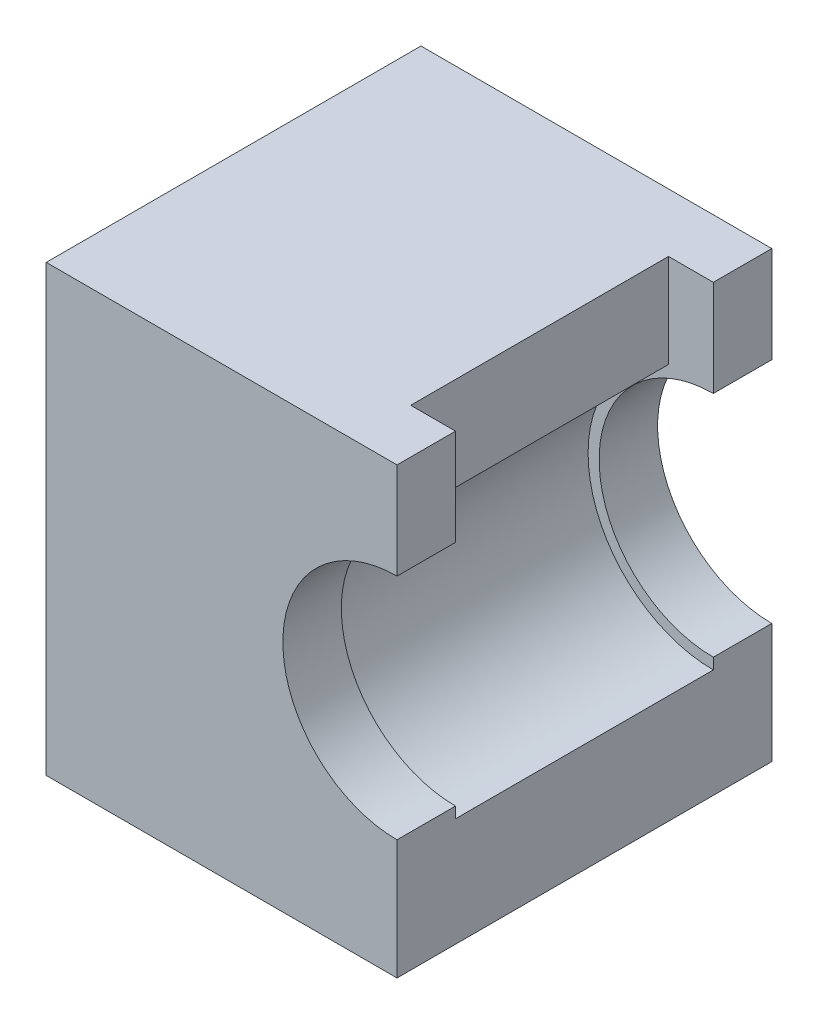
ISO-10303-21;
HEADER;
FILE_DESCRIPTION(('STEP AP214'),'2;1');
FILE_NAME('part.step','',(''),(''),'','','');
FILE_SCHEMA(('AUTOMOTIVE_DESIGN { 1 0 10303 214 1 1 1 1 }'));
ENDSEC;
DATA;
#1=APPLICATION_CONTEXT('core data for automotive mechanical design processes');
#2=APPLICATION_PROTOCOL_DEFINITION('international standard','automotive_design',2000,#1);
#3=PRODUCT_CONTEXT('',#1,'mechanical');
#4=PRODUCT('Part','Part','',(#3));
#5=PRODUCT_RELATED_PRODUCT_CATEGORY('part','',(#4));
#6=PRODUCT_DEFINITION_FORMATION('','',#4);
#7=PRODUCT_DEFINITION_CONTEXT('part definition',#1,'design');
#8=PRODUCT_DEFINITION('design','',#6,#7);
#9=PRODUCT_DEFINITION_SHAPE('','',#8);
#10=(LENGTH_UNIT() NAMED_UNIT(*) SI_UNIT(.MILLI.,.METRE.));
#11=(NAMED_UNIT(*) PLANE_ANGLE_UNIT() SI_UNIT($,.RADIAN.));
#12=(NAMED_UNIT(*) SI_UNIT($,.STERADIAN.) SOLID_ANGLE_UNIT());
#13=UNCERTAINTY_MEASURE_WITH_UNIT(LENGTH_MEASURE(1.E-05),#10,'distance_accuracy_value','');
#14=(GEOMETRIC_REPRESENTATION_CONTEXT(3) GLOBAL_UNCERTAINTY_ASSIGNED_CONTEXT((#13)) GLOBAL_UNIT_ASSIGNED_CONTEXT((#10,
#11,#12)) REPRESENTATION_CONTEXT('',''));
#15=CARTESIAN_POINT('',(0.,0.,0.));
#16=DIRECTION('',(0.,0.,1.));
#17=DIRECTION('',(1.,0.,0.));
#18=AXIS2_PLACEMENT_3D('',#15,#16,#17);
#19=CARTESIAN_POINT('',(0.,-6.35,7.));
#20=DIRECTION('',(0.,1.,0.));
#21=DIRECTION('',(0.,0.,1.));
#22=AXIS2_PLACEMENT_3D('',#19,#20,#21);
#23=PLANE('',#22);
#24=DIRECTION('',(0.,0.,-1.));
#25=VECTOR('',#24,1.);
#26=CARTESIAN_POINT('',(-9.525,-6.35,7.));
#27=LINE('',#26,#25);
#28=CARTESIAN_POINT('',(-9.525,-6.35,8.5875));
#29=VERTEX_POINT('',#28);
#30=CARTESIAN_POINT('',(-9.525,-6.35,-1.5875));
#31=VERTEX_POINT('',#30);
#32=EDGE_CURVE('E214',#29,#31,#27,.T.);
#33=ORIENTED_EDGE('',*,*,#32,.T.);
#34=DIRECTION('',(1.,0.,0.));
#35=VECTOR('',#34,1.);
#36=CARTESIAN_POINT('',(0.,-6.35,-1.5875));
#37=LINE('',#36,#35);
#38=CARTESIAN_POINT('',(0.,-6.35,-1.5875));
#39=VERTEX_POINT('',#38);
#40=EDGE_CURVE('E216',#31,#39,#37,.T.);
#41=ORIENTED_EDGE('',*,*,#40,.T.);
#42=DIRECTION('',(0.,0.,-1.));
#43=VECTOR('',#42,1.);
#44=CARTESIAN_POINT('',(0.,-6.35,7.));
#45=LINE('',#44,#43);
#46=CARTESIAN_POINT('',(0.,-6.35,8.5875));
#47=VERTEX_POINT('',#46);
#48=EDGE_CURVE('E130',#47,#39,#45,.T.);
#49=ORIENTED_EDGE('',*,*,#48,.F.);
#50=DIRECTION('',(1.,0.,0.));
#51=VECTOR('',#50,1.);
#52=CARTESIAN_POINT('',(0.,-6.35,8.5875));
#53=LINE('',#52,#51);
#54=EDGE_CURVE('E219',#29,#47,#53,.T.);
#55=ORIENTED_EDGE('',*,*,#54,.F.);
#56=EDGE_LOOP('',(#33,#41,#49,#55));
#57=FACE_BOUND('',#56,.T.);
#58=ADVANCED_FACE('F119',(#57),#23,.F.);
#59=CARTESIAN_POINT('',(0.,0.,7.));
#60=DIRECTION('',(-1.,0.,0.));
#61=DIRECTION('',(0.,0.,1.));
#62=AXIS2_PLACEMENT_3D('',#59,#60,#61);
#63=PLANE('',#62);
#64=ORIENTED_EDGE('',*,*,#48,.T.);
#65=DIRECTION('',(0.,1.,0.));
#66=VECTOR('',#65,1.);
#67=CARTESIAN_POINT('',(0.,0.,-1.5875));
#68=LINE('',#67,#66);
#69=CARTESIAN_POINT('',(0.,-3.10000000000001,-1.5875));
#70=VERTEX_POINT('',#69);
#71=EDGE_CURVE('E234',#39,#70,#68,.T.);
#72=ORIENTED_EDGE('',*,*,#71,.T.);
#73=DIRECTION('',(0.,0.,1.));
#74=VECTOR('',#73,1.);
#75=CARTESIAN_POINT('',(0.,-3.10000000000001,-1.5875));
#76=LINE('',#75,#74);
#77=CARTESIAN_POINT('',(0.,-3.10000000000001,0.));
#78=VERTEX_POINT('',#77);
#79=EDGE_CURVE('E253',#70,#78,#76,.T.);
#80=ORIENTED_EDGE('',*,*,#79,.T.);
#81=DIRECTION('',(0.,1.,0.));
#82=VECTOR('',#81,1.);
#83=CARTESIAN_POINT('',(0.,0.,0.));
#84=LINE('',#83,#82);
#85=CARTESIAN_POINT('',(0.,-3.4,0.));
#86=VERTEX_POINT('',#85);
#87=EDGE_CURVE('E236',#86,#78,#84,.T.);
#88=ORIENTED_EDGE('',*,*,#87,.F.);
#89=DIRECTION('',(0.,0.,-1.));
#90=VECTOR('',#89,1.);
#91=CARTESIAN_POINT('',(0.,-3.4,7.));
#92=LINE('',#91,#90);
#93=CARTESIAN_POINT('',(0.,-3.4,7.));
#94=VERTEX_POINT('',#93);
#95=EDGE_CURVE('E139',#94,#86,#92,.T.);
#96=ORIENTED_EDGE('',*,*,#95,.F.);
#97=DIRECTION('',(0.,1.,0.));
#98=VECTOR('',#97,1.);
#99=CARTESIAN_POINT('',(0.,0.,7.));
#100=LINE('',#99,#98);
#101=CARTESIAN_POINT('',(0.,-3.10000000000001,7.));
#102=VERTEX_POINT('',#101);
#103=EDGE_CURVE('E277',#94,#102,#100,.T.);
#104=ORIENTED_EDGE('',*,*,#103,.T.);
#105=DIRECTION('',(0.,0.,-1.));
#106=VECTOR('',#105,1.);
#107=CARTESIAN_POINT('',(0.,-3.10000000000001,8.5875));
#108=LINE('',#107,#106);
#109=CARTESIAN_POINT('',(0.,-3.10000000000001,8.5875));
#110=VERTEX_POINT('',#109);
#111=EDGE_CURVE('E318',#110,#102,#108,.T.);
#112=ORIENTED_EDGE('',*,*,#111,.F.);
#113=DIRECTION('',(0.,1.,0.));
#114=VECTOR('',#113,1.);
#115=CARTESIAN_POINT('',(0.,0.,8.5875));
#116=LINE('',#115,#114);
#117=EDGE_CURVE('E280',#47,#110,#116,.T.);
#118=ORIENTED_EDGE('',*,*,#117,.F.);
#119=EDGE_LOOP('',(#64,#72,#80,#88,#96,#104,#112,#118));
#120=FACE_BOUND('',#119,.T.);
#121=ADVANCED_FACE('F380',(#120),#63,.F.);
#122=CARTESIAN_POINT('',(0.,0.,7.));
#123=DIRECTION('',(0.,0.,-1.));
#124=DIRECTION('',(-1.,0.,0.));
#125=AXIS2_PLACEMENT_3D('',#122,#123,#124);
#126=CYLINDRICAL_SURFACE('',#125,3.4);
#127=CARTESIAN_POINT('',(0.,0.,0.));
#128=DIRECTION('',(0.,0.,1.));
#129=DIRECTION('',(1.,0.,0.));
#130=AXIS2_PLACEMENT_3D('',#127,#128,#129);
#131=CIRCLE('',#130,3.4);
#132=CARTESIAN_POINT('',(-1.21629560551701,3.175,0.));
#133=VERTEX_POINT('',#132);
#134=EDGE_CURVE('E225',#133,#86,#131,.T.);
#135=ORIENTED_EDGE('',*,*,#134,.F.);
#136=DIRECTION('',(0.,0.,-1.));
#137=VECTOR('',#136,1.);
#138=CARTESIAN_POINT('',(-1.21629560551701,3.175,7.));
#139=LINE('',#138,#137);
#140=CARTESIAN_POINT('',(-1.21629560551701,3.175,7.));
#141=VERTEX_POINT('',#140);
#142=EDGE_CURVE('E12',#141,#133,#139,.T.);
#143=ORIENTED_EDGE('',*,*,#142,.F.);
#144=CARTESIAN_POINT('',(0.,0.,7.));
#145=DIRECTION('',(0.,0.,1.));
#146=DIRECTION('',(1.,0.,0.));
#147=AXIS2_PLACEMENT_3D('',#144,#145,#146);
#148=CIRCLE('',#147,3.4);
#149=EDGE_CURVE('E322',#141,#94,#148,.T.);
#150=ORIENTED_EDGE('',*,*,#149,.T.);
#151=ORIENTED_EDGE('',*,*,#95,.T.);
#152=EDGE_LOOP('',(#135,#143,#150,#151));
#153=FACE_BOUND('',#152,.T.);
#154=ADVANCED_FACE('F375',(#153),#126,.F.);
#155=CARTESIAN_POINT('',(-9.525,3.175,7.));
#156=DIRECTION('',(1.,0.,0.));
#157=DIRECTION('',(0.,0.,-1.));
#158=AXIS2_PLACEMENT_3D('',#155,#156,#157);
#159=PLANE('',#158);
#160=DIRECTION('',(0.,0.,-1.));
#161=VECTOR('',#160,1.);
#162=CARTESIAN_POINT('',(-9.525,5.715,7.));
#163=LINE('',#162,#161);
#164=CARTESIAN_POINT('',(-9.525,5.715,8.5875));
#165=VERTEX_POINT('',#164);
#166=CARTESIAN_POINT('',(-9.525,5.715,-1.5875));
#167=VERTEX_POINT('',#166);
#168=EDGE_CURVE('E123',#165,#167,#163,.T.);
#169=ORIENTED_EDGE('',*,*,#168,.T.);
#170=DIRECTION('',(0.,-1.,0.));
#171=VECTOR('',#170,1.);
#172=CARTESIAN_POINT('',(-9.525,0.,-1.5875));
#173=LINE('',#172,#171);
#174=EDGE_CURVE('E231',#167,#31,#173,.T.);
#175=ORIENTED_EDGE('',*,*,#174,.T.);
#176=ORIENTED_EDGE('',*,*,#32,.F.);
#177=DIRECTION('',(0.,-1.,0.));
#178=VECTOR('',#177,1.);
#179=CARTESIAN_POINT('',(-9.525,0.,8.5875));
#180=LINE('',#179,#178);
#181=EDGE_CURVE('E296',#165,#29,#180,.T.);
#182=ORIENTED_EDGE('',*,*,#181,.F.);
#183=EDGE_LOOP('',(#169,#175,#176,#182));
#184=FACE_BOUND('',#183,.T.);
#185=ADVANCED_FACE('F238',(#184),#159,.F.);
#186=CARTESIAN_POINT('',(-1.21629560551701,3.175,7.));
#187=DIRECTION('',(-1.,0.,0.));
#188=DIRECTION('',(0.,0.,1.));
#189=AXIS2_PLACEMENT_3D('',#186,#187,#188);
#190=PLANE('',#189);
#191=DIRECTION('',(0.,1.,0.));
#192=VECTOR('',#191,1.);
#193=CARTESIAN_POINT('',(-1.21629560551701,3.175,0.));
#194=LINE('',#193,#192);
#195=CARTESIAN_POINT('',(-1.21629560551701,5.715,0.));
#196=VERTEX_POINT('',#195);
#197=EDGE_CURVE('E152',#133,#196,#194,.T.);
#198=ORIENTED_EDGE('',*,*,#197,.T.);
#199=DIRECTION('',(0.,0.,-1.));
#200=VECTOR('',#199,1.);
#201=CARTESIAN_POINT('',(-1.21629560551701,5.715,7.));
#202=LINE('',#201,#200);
#203=CARTESIAN_POINT('',(-1.21629560551701,5.715,7.));
#204=VERTEX_POINT('',#203);
#205=EDGE_CURVE('E155',#204,#196,#202,.T.);
#206=ORIENTED_EDGE('',*,*,#205,.F.);
#207=DIRECTION('',(0.,1.,0.));
#208=VECTOR('',#207,1.);
#209=CARTESIAN_POINT('',(-1.21629560551701,3.175,7.));
#210=LINE('',#209,#208);
#211=EDGE_CURVE('E332',#141,#204,#210,.T.);
#212=ORIENTED_EDGE('',*,*,#211,.F.);
#213=ORIENTED_EDGE('',*,*,#142,.T.);
#214=EDGE_LOOP('',(#198,#206,#212,#213));
#215=FACE_BOUND('',#214,.T.);
#216=ADVANCED_FACE('F366',(#215),#190,.F.);
#217=CARTESIAN_POINT('',(-1.21629560551701,5.715,7.));
#218=DIRECTION('',(0.,-1.,0.));
#219=DIRECTION('',(1.,0.,0.));
#220=AXIS2_PLACEMENT_3D('',#217,#218,#219);
#221=PLANE('',#220);
#222=ORIENTED_EDGE('',*,*,#205,.T.);
#223=DIRECTION('',(-1.,0.,0.));
#224=VECTOR('',#223,1.);
#225=CARTESIAN_POINT('',(0.,5.715,0.));
#226=LINE('',#225,#224);
#227=CARTESIAN_POINT('',(0.,5.715,0.));
#228=VERTEX_POINT('',#227);
#229=EDGE_CURVE('E254',#228,#196,#226,.T.);
#230=ORIENTED_EDGE('',*,*,#229,.F.);
#231=DIRECTION('',(0.,0.,1.));
#232=VECTOR('',#231,1.);
#233=CARTESIAN_POINT('',(0.,5.715,-1.5875));
#234=LINE('',#233,#232);
#235=CARTESIAN_POINT('',(0.,5.715,-1.5875));
#236=VERTEX_POINT('',#235);
#237=EDGE_CURVE('E274',#236,#228,#234,.T.);
#238=ORIENTED_EDGE('',*,*,#237,.F.);
#239=DIRECTION('',(-1.,0.,0.));
#240=VECTOR('',#239,1.);
#241=CARTESIAN_POINT('',(0.,5.715,-1.5875));
#242=LINE('',#241,#240);
#243=EDGE_CURVE('E240',#236,#167,#242,.T.);
#244=ORIENTED_EDGE('',*,*,#243,.T.);
#245=ORIENTED_EDGE('',*,*,#168,.F.);
#246=DIRECTION('',(-1.,0.,0.));
#247=VECTOR('',#246,1.);
#248=CARTESIAN_POINT('',(0.,5.715,8.5875));
#249=LINE('',#248,#247);
#250=CARTESIAN_POINT('',(0.,5.715,8.5875));
#251=VERTEX_POINT('',#250);
#252=EDGE_CURVE('E292',#251,#165,#249,.T.);
#253=ORIENTED_EDGE('',*,*,#252,.F.);
#254=DIRECTION('',(0.,0.,-1.));
#255=VECTOR('',#254,1.);
#256=CARTESIAN_POINT('',(0.,5.715,8.5875));
#257=LINE('',#256,#255);
#258=CARTESIAN_POINT('',(0.,5.715,7.));
#259=VERTEX_POINT('',#258);
#260=EDGE_CURVE('E299',#251,#259,#257,.T.);
#261=ORIENTED_EDGE('',*,*,#260,.T.);
#262=DIRECTION('',(-1.,0.,0.));
#263=VECTOR('',#262,1.);
#264=CARTESIAN_POINT('',(0.,5.715,7.));
#265=LINE('',#264,#263);
#266=EDGE_CURVE('E281',#259,#204,#265,.T.);
#267=ORIENTED_EDGE('',*,*,#266,.T.);
#268=EDGE_LOOP('',(#222,#230,#238,#244,#245,#253,#261,#267));
#269=FACE_BOUND('',#268,.T.);
#270=ADVANCED_FACE('F121',(#269),#221,.F.);
#271=CARTESIAN_POINT('',(0.,0.,8.5875));
#272=DIRECTION('',(0.,0.,-1.));
#273=DIRECTION('',(-1.,0.,0.));
#274=AXIS2_PLACEMENT_3D('',#271,#272,#273);
#275=CYLINDRICAL_SURFACE('',#274,3.10000000000001);
#276=CARTESIAN_POINT('',(0.,0.,7.));
#277=DIRECTION('',(0.,0.,1.));
#278=DIRECTION('',(1.,0.,0.));
#279=AXIS2_PLACEMENT_3D('',#276,#277,#278);
#280=CIRCLE('',#279,3.10000000000001);
#281=CARTESIAN_POINT('',(0.,3.10000000000001,7.));
#282=VERTEX_POINT('',#281);
#283=EDGE_CURVE('E302',#282,#102,#280,.T.);
#284=ORIENTED_EDGE('',*,*,#283,.F.);
#285=DIRECTION('',(0.,0.,-1.));
#286=VECTOR('',#285,1.);
#287=CARTESIAN_POINT('',(0.,3.10000000000001,8.5875));
#288=LINE('',#287,#286);
#289=CARTESIAN_POINT('',(0.,3.10000000000001,8.5875));
#290=VERTEX_POINT('',#289);
#291=EDGE_CURVE('E315',#290,#282,#288,.T.);
#292=ORIENTED_EDGE('',*,*,#291,.F.);
#293=CARTESIAN_POINT('',(0.,0.,8.5875));
#294=DIRECTION('',(0.,0.,1.));
#295=DIRECTION('',(1.,0.,0.));
#296=AXIS2_PLACEMENT_3D('',#293,#294,#295);
#297=CIRCLE('',#296,3.10000000000001);
#298=EDGE_CURVE('E284',#290,#110,#297,.T.);
#299=ORIENTED_EDGE('',*,*,#298,.T.);
#300=ORIENTED_EDGE('',*,*,#111,.T.);
#301=EDGE_LOOP('',(#284,#292,#299,#300));
#302=FACE_BOUND('',#301,.T.);
#303=ADVANCED_FACE('F373',(#302),#275,.F.);
#304=CARTESIAN_POINT('',(0.,0.,8.5875));
#305=DIRECTION('',(1.,0.,0.));
#306=DIRECTION('',(0.,0.,-1.));
#307=AXIS2_PLACEMENT_3D('',#304,#305,#306);
#308=PLANE('',#307);
#309=DIRECTION('',(0.,-1.,0.));
#310=VECTOR('',#309,1.);
#311=CARTESIAN_POINT('',(0.,0.,7.));
#312=LINE('',#311,#310);
#313=EDGE_CURVE('E306',#259,#282,#312,.T.);
#314=ORIENTED_EDGE('',*,*,#313,.F.);
#315=ORIENTED_EDGE('',*,*,#260,.F.);
#316=DIRECTION('',(0.,-1.,0.));
#317=VECTOR('',#316,1.);
#318=CARTESIAN_POINT('',(0.,0.,8.5875));
#319=LINE('',#318,#317);
#320=EDGE_CURVE('E288',#251,#290,#319,.T.);
#321=ORIENTED_EDGE('',*,*,#320,.T.);
#322=ORIENTED_EDGE('',*,*,#291,.T.);
#323=EDGE_LOOP('',(#314,#315,#321,#322));
#324=FACE_BOUND('',#323,.T.);
#325=ADVANCED_FACE('F360',(#324),#308,.T.);
#326=CARTESIAN_POINT('',(0.,0.,8.5875));
#327=DIRECTION('',(0.,0.,1.));
#328=DIRECTION('',(1.,0.,0.));
#329=AXIS2_PLACEMENT_3D('',#326,#327,#328);
#330=PLANE('',#329);
#331=ORIENTED_EDGE('',*,*,#54,.T.);
#332=ORIENTED_EDGE('',*,*,#117,.T.);
#333=ORIENTED_EDGE('',*,*,#298,.F.);
#334=ORIENTED_EDGE('',*,*,#320,.F.);
#335=ORIENTED_EDGE('',*,*,#252,.T.);
#336=ORIENTED_EDGE('',*,*,#181,.T.);
#337=EDGE_LOOP('',(#331,#332,#333,#334,#335,#336));
#338=FACE_BOUND('',#337,.T.);
#339=ADVANCED_FACE('F356',(#338),#330,.T.);
#340=CARTESIAN_POINT('',(0.,0.,7.));
#341=DIRECTION('',(0.,0.,1.));
#342=DIRECTION('',(1.,0.,0.));
#343=AXIS2_PLACEMENT_3D('',#340,#341,#342);
#344=PLANE('',#343);
#345=ORIENTED_EDGE('',*,*,#149,.F.);
#346=ORIENTED_EDGE('',*,*,#211,.T.);
#347=ORIENTED_EDGE('',*,*,#266,.F.);
#348=ORIENTED_EDGE('',*,*,#313,.T.);
#349=ORIENTED_EDGE('',*,*,#283,.T.);
#350=ORIENTED_EDGE('',*,*,#103,.F.);
#351=EDGE_LOOP('',(#345,#346,#347,#348,#349,#350));
#352=FACE_BOUND('',#351,.T.);
#353=ADVANCED_FACE('F364',(#352),#344,.F.);
#354=CARTESIAN_POINT('',(0.,0.,-1.5875));
#355=DIRECTION('',(-1.,0.,0.));
#356=DIRECTION('',(0.,0.,1.));
#357=AXIS2_PLACEMENT_3D('',#354,#355,#356);
#358=PLANE('',#357);
#359=DIRECTION('',(0.,-1.,0.));
#360=VECTOR('',#359,1.);
#361=CARTESIAN_POINT('',(0.,0.,0.));
#362=LINE('',#361,#360);
#363=CARTESIAN_POINT('',(0.,3.10000000000001,0.));
#364=VERTEX_POINT('',#363);
#365=EDGE_CURVE('E258',#228,#364,#362,.T.);
#366=ORIENTED_EDGE('',*,*,#365,.T.);
#367=DIRECTION('',(0.,0.,1.));
#368=VECTOR('',#367,1.);
#369=CARTESIAN_POINT('',(0.,3.10000000000001,-1.5875));
#370=LINE('',#369,#368);
#371=CARTESIAN_POINT('',(0.,3.10000000000001,-1.5875));
#372=VERTEX_POINT('',#371);
#373=EDGE_CURVE('E270',#372,#364,#370,.T.);
#374=ORIENTED_EDGE('',*,*,#373,.F.);
#375=DIRECTION('',(0.,-1.,0.));
#376=VECTOR('',#375,1.);
#377=CARTESIAN_POINT('',(0.,0.,-1.5875));
#378=LINE('',#377,#376);
#379=EDGE_CURVE('E243',#236,#372,#378,.T.);
#380=ORIENTED_EDGE('',*,*,#379,.F.);
#381=ORIENTED_EDGE('',*,*,#237,.T.);
#382=EDGE_LOOP('',(#366,#374,#380,#381));
#383=FACE_BOUND('',#382,.T.);
#384=ADVANCED_FACE('F347',(#383),#358,.F.);
#385=CARTESIAN_POINT('',(0.,0.,-1.5875));
#386=DIRECTION('',(0.,0.,1.));
#387=DIRECTION('',(1.,0.,0.));
#388=AXIS2_PLACEMENT_3D('',#385,#386,#387);
#389=CYLINDRICAL_SURFACE('',#388,3.10000000000001);
#390=CARTESIAN_POINT('',(0.,0.,0.));
#391=DIRECTION('',(0.,0.,1.));
#392=DIRECTION('',(1.,0.,0.));
#393=AXIS2_PLACEMENT_3D('',#390,#391,#392);
#394=CIRCLE('',#393,3.10000000000001);
#395=EDGE_CURVE('E261',#364,#78,#394,.T.);
#396=ORIENTED_EDGE('',*,*,#395,.T.);
#397=ORIENTED_EDGE('',*,*,#79,.F.);
#398=CARTESIAN_POINT('',(0.,0.,-1.5875));
#399=DIRECTION('',(0.,0.,1.));
#400=DIRECTION('',(1.,0.,0.));
#401=AXIS2_PLACEMENT_3D('',#398,#399,#400);
#402=CIRCLE('',#401,3.10000000000001);
#403=EDGE_CURVE('E248',#372,#70,#402,.T.);
#404=ORIENTED_EDGE('',*,*,#403,.F.);
#405=ORIENTED_EDGE('',*,*,#373,.T.);
#406=EDGE_LOOP('',(#396,#397,#404,#405));
#407=FACE_BOUND('',#406,.T.);
#408=ADVANCED_FACE('F351',(#407),#389,.F.);
#409=CARTESIAN_POINT('',(0.,0.,-1.5875));
#410=DIRECTION('',(0.,0.,-1.));
#411=DIRECTION('',(1.,0.,0.));
#412=AXIS2_PLACEMENT_3D('',#409,#410,#411);
#413=PLANE('',#412);
#414=ORIENTED_EDGE('',*,*,#40,.F.);
#415=ORIENTED_EDGE('',*,*,#174,.F.);
#416=ORIENTED_EDGE('',*,*,#243,.F.);
#417=ORIENTED_EDGE('',*,*,#379,.T.);
#418=ORIENTED_EDGE('',*,*,#403,.T.);
#419=ORIENTED_EDGE('',*,*,#71,.F.);
#420=EDGE_LOOP('',(#414,#415,#416,#417,#418,#419));
#421=FACE_BOUND('',#420,.T.);
#422=ADVANCED_FACE('F229',(#421),#413,.T.);
#423=CARTESIAN_POINT('',(0.,0.,0.));
#424=DIRECTION('',(0.,0.,-1.));
#425=DIRECTION('',(1.,0.,0.));
#426=AXIS2_PLACEMENT_3D('',#423,#424,#425);
#427=PLANE('',#426);
#428=ORIENTED_EDGE('',*,*,#197,.F.);
#429=ORIENTED_EDGE('',*,*,#134,.T.);
#430=ORIENTED_EDGE('',*,*,#87,.T.);
#431=ORIENTED_EDGE('',*,*,#395,.F.);
#432=ORIENTED_EDGE('',*,*,#365,.F.);
#433=ORIENTED_EDGE('',*,*,#229,.T.);
#434=EDGE_LOOP('',(#428,#429,#430,#431,#432,#433));
#435=FACE_BOUND('',#434,.T.);
#436=ADVANCED_FACE('F343',(#435),#427,.F.);
#437=CLOSED_SHELL('',(#58,#121,#154,#185,#216,#270,#303,#325,#339,#353,#384,#408,#422,#436));
#438=MANIFOLD_SOLID_BREP('B2',#437);
#439=ADVANCED_BREP_SHAPE_REPRESENTATION('',(#18,#438),#14);
#440=SHAPE_DEFINITION_REPRESENTATION(#9,#439);
ENDSEC;
END-ISO-10303-21;
